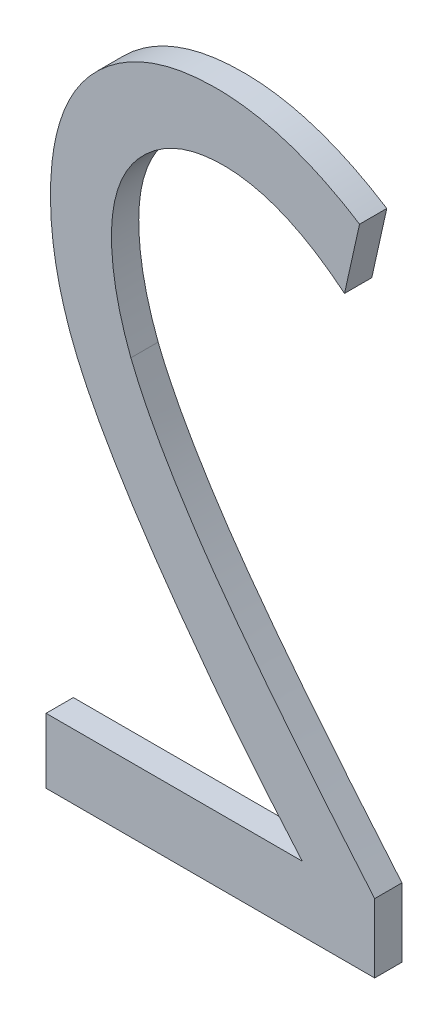
ISO-10303-21;
HEADER;
FILE_DESCRIPTION(('STEP AP214'),'2;1');
FILE_NAME('part.step','',(''),(''),'','','');
FILE_SCHEMA(('AUTOMOTIVE_DESIGN { 1 0 10303 214 1 1 1 1 }'));
ENDSEC;
DATA;
#1=APPLICATION_CONTEXT('core data for automotive mechanical design processes');
#2=APPLICATION_PROTOCOL_DEFINITION('international standard','automotive_design',2000,#1);
#3=PRODUCT_CONTEXT('',#1,'mechanical');
#4=PRODUCT('Part','Part','',(#3));
#5=PRODUCT_RELATED_PRODUCT_CATEGORY('part','',(#4));
#6=PRODUCT_DEFINITION_FORMATION('','',#4);
#7=PRODUCT_DEFINITION_CONTEXT('part definition',#1,'design');
#8=PRODUCT_DEFINITION('design','',#6,#7);
#9=PRODUCT_DEFINITION_SHAPE('','',#8);
#10=(LENGTH_UNIT() NAMED_UNIT(*) SI_UNIT(.MILLI.,.METRE.));
#11=(NAMED_UNIT(*) PLANE_ANGLE_UNIT() SI_UNIT($,.RADIAN.));
#12=(NAMED_UNIT(*) SI_UNIT($,.STERADIAN.) SOLID_ANGLE_UNIT());
#13=UNCERTAINTY_MEASURE_WITH_UNIT(LENGTH_MEASURE(1.E-05),#10,'distance_accuracy_value','');
#14=(GEOMETRIC_REPRESENTATION_CONTEXT(3) GLOBAL_UNCERTAINTY_ASSIGNED_CONTEXT((#13)) GLOBAL_UNIT_ASSIGNED_CONTEXT((#10,
#11,#12)) REPRESENTATION_CONTEXT('',''));
#15=CARTESIAN_POINT('',(0.,0.,0.));
#16=DIRECTION('',(0.,0.,1.));
#17=DIRECTION('',(1.,0.,0.));
#18=AXIS2_PLACEMENT_3D('',#15,#16,#17);
#19=CARTESIAN_POINT('',(172.152131752685,125.948278329335,-39.));
#20=DIRECTION('',(0.,0.,1.));
#21=DIRECTION('',(1.,0.,0.));
#22=AXIS2_PLACEMENT_3D('',#19,#20,#21);
#23=PLANE('',#22);
#24=DIRECTION('',(1.,0.,0.));
#25=VECTOR('',#24,1.);
#26=CARTESIAN_POINT('',(172.152131752685,125.152214694954,-39.));
#27=LINE('',#26,#25);
#28=CARTESIAN_POINT('',(172.504372600126,125.152214694954,-39.));
#29=VERTEX_POINT('',#28);
#30=CARTESIAN_POINT('',(171.564829497766,125.152214694954,-39.));
#31=VERTEX_POINT('',#30);
#32=EDGE_CURVE('E128',#29,#31,#27,.F.);
#33=ORIENTED_EDGE('',*,*,#32,.T.);
#34=DIRECTION('',(0.,1.,0.));
#35=VECTOR('',#34,1.);
#36=CARTESIAN_POINT('',(171.564829497766,125.948278329335,-39.));
#37=LINE('',#36,#35);
#38=CARTESIAN_POINT('',(171.564829497766,124.913993413852,-39.));
#39=VERTEX_POINT('',#38);
#40=EDGE_CURVE('E108',#31,#39,#37,.F.);
#41=ORIENTED_EDGE('',*,*,#40,.T.);
#42=DIRECTION('',(1.,0.,0.));
#43=VECTOR('',#42,1.);
#44=CARTESIAN_POINT('',(172.152131752685,124.913993413852,-39.));
#45=LINE('',#44,#43);
#46=CARTESIAN_POINT('',(172.769928576398,124.913993413852,-39.));
#47=VERTEX_POINT('',#46);
#48=EDGE_CURVE('E104',#39,#47,#45,.T.);
#49=ORIENTED_EDGE('',*,*,#48,.T.);
#50=DIRECTION('',(0.,1.,0.));
#51=VECTOR('',#50,1.);
#52=CARTESIAN_POINT('',(172.769928576398,124.913993413852,-39.));
#53=LINE('',#52,#51);
#54=CARTESIAN_POINT('',(172.769928576398,125.166110936351,-39.));
#55=VERTEX_POINT('',#54);
#56=EDGE_CURVE('E102',#55,#47,#53,.F.);
#57=ORIENTED_EDGE('',*,*,#56,.F.);
#58=CARTESIAN_POINT('',(171.87582280838,126.436624435557,-39.));
#59=CARTESIAN_POINT('',(171.881983858144,126.421132313016,-39.));
#60=CARTESIAN_POINT('',(171.888443153463,126.405762428981,-39.));
#61=CARTESIAN_POINT('',(171.901871322364,126.375247302634,-39.));
#62=CARTESIAN_POINT('',(171.90884016978,126.360102048836,-39.));
#63=CARTESIAN_POINT('',(171.923200941284,126.3300152623,-39.));
#64=CARTESIAN_POINT('',(171.930592851294,126.315073722804,-39.));
#65=CARTESIAN_POINT('',(171.945739448055,126.285376729993,-39.));
#66=CARTESIAN_POINT('',(171.953494126673,126.270621272514,-39.));
#67=CARTESIAN_POINT('',(171.977229339857,126.226603293513,-39.));
#68=CARTESIAN_POINT('',(171.993679195379,126.197592989437,-39.));
#69=CARTESIAN_POINT('',(172.019075462227,126.154512475279,-39.));
#70=CARTESIAN_POINT('',(172.027660405136,126.140225937032,-39.));
#71=CARTESIAN_POINT('',(172.053742700012,126.097562698147,-39.));
#72=CARTESIAN_POINT('',(172.071566375779,126.069384376933,-39.));
#73=CARTESIAN_POINT('',(172.098821546063,126.027460170251,-39.));
#74=CARTESIAN_POINT('',(172.107992817339,126.013543222797,-39.));
#75=CARTESIAN_POINT('',(172.1357651372,125.971961757683,-39.));
#76=CARTESIAN_POINT('',(172.154623669505,125.944468232993,-39.));
#77=CARTESIAN_POINT('',(172.192975090024,125.889930433792,-39.));
#78=CARTESIAN_POINT('',(172.212467962489,125.862886148153,-39.));
#79=CARTESIAN_POINT('',(172.25189245836,125.809121395733,-39.));
#80=CARTESIAN_POINT('',(172.271824072452,125.782400922097,-39.));
#81=CARTESIAN_POINT('',(172.312040551999,125.729228009605,-39.));
#82=CARTESIAN_POINT('',(172.332325413574,125.70277556781,-39.));
#83=CARTESIAN_POINT('',(172.373178187355,125.650090768106,-39.));
#84=CARTESIAN_POINT('',(172.393746097793,125.623858408825,-39.));
#85=CARTESIAN_POINT('',(172.435117903595,125.571580851571,-39.));
#86=CARTESIAN_POINT('',(172.455921798059,125.545535652887,-39.));
#87=CARTESIAN_POINT('',(172.518632028841,125.467638921907,-39.));
#88=CARTESIAN_POINT('',(172.560836279493,125.416027066146,-39.));
#89=CARTESIAN_POINT('',(172.624587732708,125.338980235817,-39.));
#90=CARTESIAN_POINT('',(172.64591217377,125.31336004769,-39.));
#91=CARTESIAN_POINT('',(172.701353589732,125.247101268435,-39.));
#92=CARTESIAN_POINT('',(172.735572534049,125.206547984025,-39.));
#93=CARTESIAN_POINT('',(172.769928576398,125.166110936351,-39.));
#94=B_SPLINE_CURVE_WITH_KNOTS('',3,(#58,#59,#60,#61,#62,#63,#64,#65,#66,#67,#68,#69,#70,#71,#72,
#73,#74,#75,#76,#77,#78,#79,#80,#81,#82,#83,#84,#85,#86,#87,#88,#89,#90,#91,#92,#93),
.UNSPECIFIED.,.F.,.F.,(4,2,2,2,2,2,2,2,2,2,2,2,2,2,2,2,2,4),(0.,0.0500087757287094,
0.100014985312841,0.150019531808065,0.200022957623796,0.300042550380344,0.35004422430103,
0.450054488447379,0.500055433134822,0.600063057039073,0.700068199814375,0.800071221646831,
0.90007314568391,1.00007444573219,1.10007536526154,1.30008029152962,1.40008068587392,
1.55926333786806),.UNSPECIFIED.);
#95=CARTESIAN_POINT('',(171.87582280838,126.436624435557,-39.));
#96=VERTEX_POINT('',#95);
#97=EDGE_CURVE('E24',#96,#55,#94,.T.);
#98=ORIENTED_EDGE('',*,*,#97,.F.);
#99=CARTESIAN_POINT('',(172.659364396163,127.032839364091,-39.));
#100=CARTESIAN_POINT('',(172.633559644265,127.053892125233,-39.));
#101=CARTESIAN_POINT('',(172.60687374249,127.074000949937,-39.));
#102=CARTESIAN_POINT('',(172.551328052937,127.111647626545,-39.));
#103=CARTESIAN_POINT('',(172.522447439633,127.129154494778,-39.));
#104=CARTESIAN_POINT('',(172.462515914962,127.16048662411,-39.));
#105=CARTESIAN_POINT('',(172.431454700589,127.17429268314,-39.));
#106=CARTESIAN_POINT('',(172.3675885985,127.196769154013,-39.));
#107=CARTESIAN_POINT('',(172.334791698886,127.205461184089,-39.));
#108=CARTESIAN_POINT('',(172.288117585217,127.213244571093,-39.));
#109=CARTESIAN_POINT('',(172.274655790862,127.214968783175,-39.));
#110=CARTESIAN_POINT('',(172.247632643865,127.217341189161,-39.));
#111=CARTESIAN_POINT('',(172.234071276289,127.217989218195,-39.));
#112=CARTESIAN_POINT('',(172.206932343972,127.218225631912,-39.));
#113=CARTESIAN_POINT('',(172.193354774423,127.217813431986,-39.));
#114=CARTESIAN_POINT('',(172.166279612185,127.215908870563,-39.));
#115=CARTESIAN_POINT('',(172.152782001622,127.214416760413,-39.));
#116=CARTESIAN_POINT('',(172.117487953358,127.208876445988,-39.));
#117=CARTESIAN_POINT('',(172.095835755627,127.203808940999,-39.));
#118=CARTESIAN_POINT('',(172.053728568641,127.190100637508,-39.));
#119=CARTESIAN_POINT('',(172.033271275275,127.181466993905,-39.));
#120=CARTESIAN_POINT('',(171.994165165284,127.160663213691,-39.));
#121=CARTESIAN_POINT('',(171.97552048043,127.148485238908,-39.));
#122=CARTESIAN_POINT('',(171.94934009155,127.127964627676,-39.));
#123=CARTESIAN_POINT('',(171.940900933963,127.120737580784,-39.));
#124=CARTESIAN_POINT('',(171.924618260857,127.105636316063,-39.));
#125=CARTESIAN_POINT('',(171.916774793972,127.097762045503,-39.));
#126=CARTESIAN_POINT('',(171.901789648385,127.081401713745,-39.));
#127=CARTESIAN_POINT('',(171.894646393252,127.072917105028,-39.));
#128=CARTESIAN_POINT('',(171.881170259032,127.055332912896,-39.));
#129=CARTESIAN_POINT('',(171.874837130112,127.046233520402,-39.));
#130=CARTESIAN_POINT('',(171.857140554517,127.018179588418,-39.));
#131=CARTESIAN_POINT('',(171.847031651905,126.998416641935,-39.));
#132=CARTESIAN_POINT('',(171.828931987802,126.954227978385,-39.));
#133=CARTESIAN_POINT('',(171.821539713918,126.92956239722,-39.));
#134=CARTESIAN_POINT('',(171.810820590911,126.879305951644,-39.));
#135=CARTESIAN_POINT('',(171.807510280605,126.853711752753,-39.));
#136=CARTESIAN_POINT('',(171.804523608971,126.806551172575,-39.));
#137=CARTESIAN_POINT('',(171.804341920893,126.785009869473,-39.));
#138=CARTESIAN_POINT('',(171.805704718384,126.741972564921,-39.));
#139=CARTESIAN_POINT('',(171.807250614432,126.720476614865,-39.));
#140=CARTESIAN_POINT('',(171.811956729691,126.677627307791,-39.));
#141=CARTESIAN_POINT('',(171.815119671551,126.656274252997,-39.));
#142=CARTESIAN_POINT('',(171.822888095236,126.613847555166,-39.));
#143=CARTESIAN_POINT('',(171.827492830647,126.59277377342,-39.));
#144=CARTESIAN_POINT('',(171.838520012912,126.548827276361,-39.));
#145=CARTESIAN_POINT('',(171.845079600649,126.525989308046,-39.));
#146=CARTESIAN_POINT('',(171.859514075183,126.480899623098,-39.));
#147=CARTESIAN_POINT('',(171.867379863856,126.458645005542,-39.));
#148=CARTESIAN_POINT('',(171.87582280838,126.436624435557,-39.));
#149=B_SPLINE_CURVE_WITH_KNOTS('',3,(#99,#100,#101,#102,#103,#104,#105,#106,#107,#108,#109,#110,
#111,#112,#113,#114,#115,#116,#117,#118,#119,#120,#121,#122,#123,#124,#125,#126,#127,#128,#129,
#130,#131,#132,#133,#134,#135,#136,#137,#138,#139,#140,#141,#142,#143,#144,#145,#146,#147,#148),
.UNSPECIFIED.,.F.,.F.,(4,2,2,2,2,2,2,2,2,2,2,2,2,2,2,2,2,2,2,2,2,2,2,2,4),(0.,0.100017091060479,
0.201143319787862,0.302784519930578,0.403992912424064,0.444673257895539,0.485359834994031,
0.52606885149195,0.566768396115581,0.633179965507767,0.699458932732195,0.765885602128108,
0.799188569711476,0.8324942532661,0.865723143215698,0.89894176098142,0.965167907700952,
1.04200009693045,1.11914257357748,1.18368228735446,1.24827473282419,1.31297629366199,
1.37764441378679,1.44888237926652,1.51964349919595),.UNSPECIFIED.);
#150=CARTESIAN_POINT('',(172.659364396163,127.032839364091,-39.));
#151=VERTEX_POINT('',#150);
#152=EDGE_CURVE('E89',#151,#96,#149,.T.);
#153=ORIENTED_EDGE('',*,*,#152,.F.);
#154=DIRECTION('',(0.217054100601005,0.976159575792959,0.));
#155=VECTOR('',#154,1.);
#156=CARTESIAN_POINT('',(172.659364396163,127.032839364091,-39.));
#157=LINE('',#156,#155);
#158=CARTESIAN_POINT('',(172.714394056645,127.280324806124,-39.));
#159=VERTEX_POINT('',#158);
#160=EDGE_CURVE('E125',#159,#151,#157,.F.);
#161=ORIENTED_EDGE('',*,*,#160,.F.);
#162=CARTESIAN_POINT('',(172.504372600126,125.152214694954,-39.));
#163=CARTESIAN_POINT('',(172.482492762864,125.177352437158,-39.));
#164=CARTESIAN_POINT('',(172.460739243117,125.202599393354,-39.));
#165=CARTESIAN_POINT('',(172.417498566375,125.253346808572,-39.));
#166=CARTESIAN_POINT('',(172.396011579383,125.278847412402,-39.));
#167=CARTESIAN_POINT('',(172.331926903966,125.355837055005,-39.));
#168=CARTESIAN_POINT('',(172.289791775207,125.407715208436,-39.));
#169=CARTESIAN_POINT('',(172.207202430537,125.512802634338,-39.));
#170=CARTESIAN_POINT('',(172.166748471857,125.566012108527,-39.));
#171=CARTESIAN_POINT('',(172.087061356273,125.673272051005,-39.));
#172=CARTESIAN_POINT('',(172.047827300038,125.727321853466,-39.));
#173=CARTESIAN_POINT('',(171.97102675812,125.836590482849,-39.));
#174=CARTESIAN_POINT('',(171.933459987957,125.891809107946,-39.));
#175=CARTESIAN_POINT('',(171.871107820414,125.987709087949,-39.));
#176=CARTESIAN_POINT('',(171.845748306276,126.02801472736,-39.));
#177=CARTESIAN_POINT('',(171.808921498936,126.089258759104,-39.));
#178=CARTESIAN_POINT('',(171.79683640872,126.109825488198,-39.));
#179=CARTESIAN_POINT('',(171.77316147344,126.151254066613,-39.));
#180=CARTESIAN_POINT('',(171.761571824543,126.172116028556,-39.));
#181=CARTESIAN_POINT('',(171.739959986746,126.212411939061,-39.));
#182=CARTESIAN_POINT('',(171.7298878386,126.2318190186,-39.));
#183=CARTESIAN_POINT('',(171.710382137046,126.270952836367,-39.));
#184=CARTESIAN_POINT('',(171.700948557389,126.290679561413,-39.));
#185=CARTESIAN_POINT('',(171.682959550204,126.330528332224,-39.));
#186=CARTESIAN_POINT('',(171.674403928558,126.350650289425,-39.));
#187=CARTESIAN_POINT('',(171.658309446416,126.391295204578,-39.));
#188=CARTESIAN_POINT('',(171.650770591596,126.411818164769,-39.));
#189=CARTESIAN_POINT('',(171.629799032765,126.473796303652,-39.));
#190=CARTESIAN_POINT('',(171.617946434945,126.515802675121,-39.));
#191=CARTESIAN_POINT('',(171.598975205878,126.600863530484,-39.));
#192=CARTESIAN_POINT('',(171.591855090857,126.643917681475,-39.));
#193=CARTESIAN_POINT('',(171.582332013781,126.733481552714,-39.));
#194=CARTESIAN_POINT('',(171.580279793396,126.78002840288,-39.));
#195=CARTESIAN_POINT('',(171.582099409016,126.87310226004,-39.));
#196=CARTESIAN_POINT('',(171.585974373764,126.919629243576,-39.));
#197=CARTESIAN_POINT('',(171.599697933708,126.999095193341,-39.));
#198=CARTESIAN_POINT('',(171.607672304554,127.032341061517,-39.));
#199=CARTESIAN_POINT('',(171.628790119704,127.09708636468,-39.));
#200=CARTESIAN_POINT('',(171.641916716429,127.12859111382,-39.));
#201=CARTESIAN_POINT('',(171.674044742596,127.188983979123,-39.));
#202=CARTESIAN_POINT('',(171.693109510912,127.217839319992,-39.));
#203=CARTESIAN_POINT('',(171.725755690384,127.257792320831,-39.));
#204=CARTESIAN_POINT('',(171.737330993901,127.270570001373,-39.));
#205=CARTESIAN_POINT('',(171.761695619059,127.294911409495,-39.));
#206=CARTESIAN_POINT('',(171.774485173018,127.306474903873,-39.));
#207=CARTESIAN_POINT('',(171.810567803865,127.336203641336,-39.));
#208=CARTESIAN_POINT('',(171.834845948962,127.353194685371,-39.));
#209=CARTESIAN_POINT('',(171.885841152411,127.382992521343,-39.));
#210=CARTESIAN_POINT('',(171.912557635287,127.39580029733,-39.));
#211=CARTESIAN_POINT('',(171.954525770422,127.412072707861,-39.));
#212=CARTESIAN_POINT('',(171.969200375528,127.417086607056,-39.));
#213=CARTESIAN_POINT('',(171.998880684564,127.425971632875,-39.));
#214=CARTESIAN_POINT('',(172.013886110563,127.429843682218,-39.));
#215=CARTESIAN_POINT('',(172.044154471625,127.436506777138,-39.));
#216=CARTESIAN_POINT('',(172.059417737942,127.439296300942,-39.));
#217=CARTESIAN_POINT('',(172.090100550103,127.443853768477,-39.));
#218=CARTESIAN_POINT('',(172.105520166112,127.445621230833,-39.));
#219=CARTESIAN_POINT('',(172.143871406363,127.448853705655,-39.));
#220=CARTESIAN_POINT('',(172.166850783782,127.449764858281,-39.));
#221=CARTESIAN_POINT('',(172.212802502708,127.449688055442,-39.));
#222=CARTESIAN_POINT('',(172.235774843176,127.448699893226,-39.));
#223=CARTESIAN_POINT('',(172.30455631203,127.442778122788,-39.));
#224=CARTESIAN_POINT('',(172.350133298979,127.434879051073,-39.));
#225=CARTESIAN_POINT('',(172.45183364362,127.409022693598,-39.));
#226=CARTESIAN_POINT('',(172.507392945872,127.388889899008,-39.));
#227=CARTESIAN_POINT('',(172.587507580339,127.352364040463,-39.));
#228=CARTESIAN_POINT('',(172.613614450693,127.339174678222,-39.));
#229=CARTESIAN_POINT('',(172.66477153901,127.311014787855,-39.));
#230=CARTESIAN_POINT('',(172.689824134707,127.296048594945,-39.));
#231=CARTESIAN_POINT('',(172.714394056645,127.280324806124,-39.));
#232=B_SPLINE_CURVE_WITH_KNOTS('',3,(#162,#163,#164,#165,#166,#167,#168,#169,#170,#171,#172,
#173,#174,#175,#176,#177,#178,#179,#180,#181,#182,#183,#184,#185,#186,#187,#188,#189,#190,#191,
#192,#193,#194,#195,#196,#197,#198,#199,#200,#201,#202,#203,#204,#205,#206,#207,#208,#209,#210,
#211,#212,#213,#214,#215,#216,#217,#218,#219,#220,#221,#222,#223,#224,#225,#226,#227,#228,#229,
#230,#231),.UNSPECIFIED.,.F.,.F.,(4,2,2,2,2,2,2,2,2,2,2,2,2,2,2,2,2,2,2,2,2,2,2,2,2,2,2,2,2,2,2,
2,2,2,4),(0.,0.099976771829443,0.200014333832972,0.400482694365182,0.600981615675607,
0.801329041651543,1.00164215072506,1.14446996126358,1.21602823502692,1.287614584054,
1.3532007974103,1.41878431310214,1.48435329691101,1.54992264675616,1.68059526903079,
1.81122690217357,1.95067370479315,2.09019414161864,2.19241019688154,2.29429475748385,
2.39730559425315,2.44895088202885,2.5006060708841,2.58910563433528,2.67758436456468,
2.72406792285507,2.77051381463408,2.81702476375671,2.86355760104138,2.93246017383222,
3.00137024746999,3.13947724549421,3.31572993405272,3.40342355584606,3.49090745239214),.UNSPECIFIED.);
#233=EDGE_CURVE('E173',#29,#159,#232,.T.);
#234=ORIENTED_EDGE('',*,*,#233,.F.);
#235=EDGE_LOOP('',(#33,#41,#49,#57,#98,#153,#161,#234));
#236=FACE_BOUND('',#235,.T.);
#237=ADVANCED_FACE('F17',(#236),#23,.T.);
#238=CARTESIAN_POINT('',(172.769928576398,124.913993413852,-39.1));
#239=DIRECTION('',(1.,0.,0.));
#240=DIRECTION('',(0.,0.,-1.));
#241=AXIS2_PLACEMENT_3D('',#238,#239,#240);
#242=PLANE('',#241);
#243=DIRECTION('',(0.,1.,0.));
#244=VECTOR('',#243,1.);
#245=CARTESIAN_POINT('',(172.769928576398,125.948278329335,-39.1));
#246=LINE('',#245,#244);
#247=CARTESIAN_POINT('',(172.769928576398,124.913993413852,-39.1));
#248=VERTEX_POINT('',#247);
#249=CARTESIAN_POINT('',(172.769928576398,125.166110936351,-39.1));
#250=VERTEX_POINT('',#249);
#251=EDGE_CURVE('E112',#248,#250,#246,.T.);
#252=ORIENTED_EDGE('',*,*,#251,.T.);
#253=DIRECTION('',(0.,0.,-1.));
#254=VECTOR('',#253,1.);
#255=CARTESIAN_POINT('',(172.769928576398,125.166110936351,-39.05));
#256=LINE('',#255,#254);
#257=EDGE_CURVE('E98',#55,#250,#256,.T.);
#258=ORIENTED_EDGE('',*,*,#257,.F.);
#259=ORIENTED_EDGE('',*,*,#56,.T.);
#260=DIRECTION('',(0.,0.,-1.));
#261=VECTOR('',#260,1.);
#262=CARTESIAN_POINT('',(172.769928576398,124.913993413852,-39.1));
#263=LINE('',#262,#261);
#264=EDGE_CURVE('E117',#248,#47,#263,.F.);
#265=ORIENTED_EDGE('',*,*,#264,.F.);
#266=EDGE_LOOP('',(#252,#258,#259,#265));
#267=FACE_BOUND('',#266,.T.);
#268=ADVANCED_FACE('F111',(#267),#242,.T.);
#269=CARTESIAN_POINT('',(172.769928576398,125.166110936351,-39.1));
#270=CARTESIAN_POINT('',(172.769928576398,125.166110936351,-39.));
#271=CARTESIAN_POINT('',(172.478119918061,125.509546616605,-39.1));
#272=CARTESIAN_POINT('',(172.478119918061,125.509546616605,-39.));
#273=CARTESIAN_POINT('',(172.26557416519,125.780192460967,-39.1));
#274=CARTESIAN_POINT('',(172.26557416519,125.780192460967,-39.));
#275=CARTESIAN_POINT('',(172.011179993121,126.15641099938,-39.1));
#276=CARTESIAN_POINT('',(172.011179993121,126.15641099938,-39.));
#277=CARTESIAN_POINT('',(171.926308735428,126.309573085637,-39.1));
#278=CARTESIAN_POINT('',(171.926308735428,126.309573085637,-39.));
#279=CARTESIAN_POINT('',(171.87582280838,126.436624435557,-39.1));
#280=CARTESIAN_POINT('',(171.87582280838,126.436624435557,-39.));
#281=B_SPLINE_SURFACE_WITH_KNOTS('',3,1,((#269,#270),(#271,#272),(#273,#274),(#275,#276),(#277,
#278),(#279,#280)),.UNSPECIFIED.,.F.,.F.,.F.,(4,2,4),(2,2),(0.,0.525907121177191,1.),(1.,1.1),.UNSPECIFIED.);
#282=CARTESIAN_POINT('',(172.769928576398,125.166110936351,-39.1));
#283=CARTESIAN_POINT('',(172.748345551071,125.191513419227,-39.1));
#284=CARTESIAN_POINT('',(172.726816850873,125.216962250277,-39.1));
#285=CARTESIAN_POINT('',(172.68388327595,125.267964156109,-39.1));
#286=CARTESIAN_POINT('',(172.662478401303,125.293517230956,-39.1));
#287=CARTESIAN_POINT('',(172.630475383614,125.331933634558,-39.1));
#288=CARTESIAN_POINT('',(172.619825105124,125.344753553456,-39.1));
#289=CARTESIAN_POINT('',(172.587929736868,125.38325948921,-39.0999999999999));
#290=CARTESIAN_POINT('',(172.566740191261,125.408991593318,-39.1));
#291=CARTESIAN_POINT('',(172.535083192038,125.447693752213,-39.1));
#292=CARTESIAN_POINT('',(172.524552095235,125.460611785303,-39.1));
#293=CARTESIAN_POINT('',(172.503535631384,125.486484993364,-39.1));
#294=CARTESIAN_POINT('',(172.493050264346,125.499440168343,-39.1));
#295=CARTESIAN_POINT('',(172.461667752604,125.538365440216,-39.1));
#296=CARTESIAN_POINT('',(172.440844332202,125.564395119262,-39.1));
#297=CARTESIAN_POINT('',(172.409783487158,125.603577551715,-39.1));
#298=CARTESIAN_POINT('',(172.39945894737,125.616661312678,-39.1));
#299=CARTESIAN_POINT('',(172.378873505336,125.64287884194,-39.1));
#300=CARTESIAN_POINT('',(172.368612603123,125.656012610264,-39.1));
#301=CARTESIAN_POINT('',(172.348160773255,125.682334544677,-39.1));
#302=CARTESIAN_POINT('',(172.337969845645,125.695522710801,-39.1));
#303=CARTESIAN_POINT('',(172.317665465977,125.721958591561,-39.1));
#304=CARTESIAN_POINT('',(172.307552013983,125.735206306246,-39.1));
#305=CARTESIAN_POINT('',(172.287411477189,125.761767281336,-39.1));
#306=CARTESIAN_POINT('',(172.277384392483,125.775080541813,-39.1));
#307=CARTESIAN_POINT('',(172.257427376214,125.801779752349,-39.1));
#308=CARTESIAN_POINT('',(172.247497444796,125.815165702517,-39.1));
#309=CARTESIAN_POINT('',(172.227747634364,125.842018656015,-39.1));
#310=CARTESIAN_POINT('',(172.217927755575,125.855485659511,-39.1));
#311=CARTESIAN_POINT('',(172.19841511689,125.882511554603,-39.1));
#312=CARTESIAN_POINT('',(172.188722357361,125.896070446465,-39.1));
#313=CARTESIAN_POINT('',(172.16948167454,125.923290901017,-39.1));
#314=CARTESIAN_POINT('',(172.159933751861,125.936952464142,-39.1));
#315=CARTESIAN_POINT('',(172.141020397654,125.964401450942,-39.1));
#316=CARTESIAN_POINT('',(172.131654967068,125.978188875267,-39.1));
#317=CARTESIAN_POINT('',(172.113086024748,126.005872234078,-39.1));
#318=CARTESIAN_POINT('',(172.103882512332,126.019768168108,-39.1));
#319=CARTESIAN_POINT('',(172.090206608122,126.040696336037,-39.1));
#320=CARTESIAN_POINT('',(172.08566956167,126.047686393177,-39.1));
#321=CARTESIAN_POINT('',(172.072126571016,126.068701001598,-39.1));
#322=CARTESIAN_POINT('',(172.063188936829,126.082769746585,-39.1));
#323=CARTESIAN_POINT('',(172.049933733056,126.103967088467,-39.1));
#324=CARTESIAN_POINT('',(172.045540574088,126.111048516411,-39.1));
#325=CARTESIAN_POINT('',(172.036807468141,126.125244103805,-39.1));
#326=CARTESIAN_POINT('',(172.032467521198,126.132358263278,-39.1));
#327=CARTESIAN_POINT('',(172.019531563249,126.153752216135,-39.1));
#328=CARTESIAN_POINT('',(172.011019665987,126.168083115382,-39.1));
#329=CARTESIAN_POINT('',(171.998441377216,126.1896892849,-39.1));
#330=CARTESIAN_POINT('',(171.994280254651,126.196909559856,-39.1));
#331=CARTESIAN_POINT('',(171.986025162871,126.211388474837,-39.1));
#332=CARTESIAN_POINT('',(171.981931193738,126.218647114908,-39.1));
#333=CARTESIAN_POINT('',(171.973814938335,126.233204308702,-39.1));
#334=CARTESIAN_POINT('',(171.969792652168,126.24050286248,-39.1));
#335=CARTESIAN_POINT('',(171.957839951275,126.262462016431,-39.1));
#336=CARTESIAN_POINT('',(171.95002408412,126.277185427135,-39.1));
#337=CARTESIAN_POINT('',(171.938565324815,126.299406347226,-39.1));
#338=CARTESIAN_POINT('',(171.934789986831,126.306835800485,-39.1));
#339=CARTESIAN_POINT('',(171.927334619629,126.321742488232,-39.1));
#340=CARTESIAN_POINT('',(171.923654590683,126.329219722856,-39.1));
#341=CARTESIAN_POINT('',(171.916397733642,126.34422416894,-39.1));
#342=CARTESIAN_POINT('',(171.912820905903,126.351751380574,-39.1));
#343=CARTESIAN_POINT('',(171.905779500078,126.366858212728,-39.1));
#344=CARTESIAN_POINT('',(171.902314922466,126.37443783347,-39.1));
#345=CARTESIAN_POINT('',(171.895508187594,126.389651983016,-39.1));
#346=CARTESIAN_POINT('',(171.892166030974,126.397286512107,-39.1));
#347=CARTESIAN_POINT('',(171.884403158527,126.415452749111,-39.1));
#348=CARTESIAN_POINT('',(171.880041668299,126.426009763201,-39.1));
#349=CARTESIAN_POINT('',(171.87582280838,126.436624435557,-39.1));
#350=B_SPLINE_CURVE_WITH_KNOTS('',3,(#282,#283,#284,#285,#286,#287,#288,#289,#290,#291,#292,
#293,#294,#295,#296,#297,#298,#299,#300,#301,#302,#303,#304,#305,#306,#307,#308,#309,#310,#311,
#312,#313,#314,#315,#316,#317,#318,#319,#320,#321,#322,#323,#324,#325,#326,#327,#328,#329,#330,
#331,#332,#333,#334,#335,#336,#337,#338,#339,#340,#341,#342,#343,#344,#345,#346,#347,#348,#349),
.UNSPECIFIED.,.F.,.F.,(4,2,2,2,2,2,2,2,2,2,2,2,2,2,2,2,2,2,2,2,2,2,2,2,2,2,2,2,2,2,2,2,2,4),(0.,
0.100000254559602,0.200000571502422,0.250000619652506,0.350001075308066,0.400001146390097,
0.450001228333166,0.550002031145744,0.60000216263042,0.650002319417806,0.70000250845809,
0.750002739259398,0.80000302510388,0.850003384993701,0.900003846872072,0.950004453168597,
1.00000527079355,1.05000634658727,1.10000721193615,1.1250073366195,1.17500846167312,
1.20000862614633,1.22500880769712,1.27501047539736,1.30001072513171,1.32501100520883,
1.35001132079569,1.40001430863975,1.42501477479511,1.45001531215107,1.47501593588363,
1.500016665347,1.52501752549406,1.55928215406868),.UNSPECIFIED.);
#351=CARTESIAN_POINT('',(171.87582280838,126.436624435557,-39.1));
#352=VERTEX_POINT('',#351);
#353=EDGE_CURVE('E167',#250,#352,#350,.T.);
#354=DIRECTION('',(0.,0.,-1.));
#355=VECTOR('',#354,1.);
#356=CARTESIAN_POINT('',(171.87582280838,126.436624435557,-39.05));
#357=LINE('',#356,#355);
#358=EDGE_CURVE('E100',#96,#352,#357,.T.);
#359=ORIENTED_EDGE('',*,*,#353,.T.);
#360=ORIENTED_EDGE('',*,*,#358,.F.);
#361=ORIENTED_EDGE('',*,*,#97,.T.);
#362=ORIENTED_EDGE('',*,*,#257,.T.);
#363=EDGE_LOOP('',(#359,#360,#361,#362));
#364=FACE_BOUND('',#363,.T.);
#365=ADVANCED_FACE('F96',(#364),#281,.T.);
#366=CARTESIAN_POINT('',(171.87582280838,126.436624435557,-39.1));
#367=CARTESIAN_POINT('',(171.87582280838,126.436624435557,-39.));
#368=CARTESIAN_POINT('',(171.828366036956,126.560367156574,-39.1));
#369=CARTESIAN_POINT('',(171.828366036956,126.560367156574,-39.));
#370=CARTESIAN_POINT('',(171.804637651243,126.677492619782,-39.1));
#371=CARTESIAN_POINT('',(171.804637651243,126.677492619782,-39.));
#372=CARTESIAN_POINT('',(171.804637651243,126.91372872354,-39.1));
#373=CARTESIAN_POINT('',(171.804637651243,126.91372872354,-39.));
#374=CARTESIAN_POINT('',(171.839977800176,127.014972768008,-39.1));
#375=CARTESIAN_POINT('',(171.839977800176,127.014972768008,-39.));
#376=CARTESIAN_POINT('',(171.989135463589,127.175564468112,-39.1));
#377=CARTESIAN_POINT('',(171.989135463589,127.175564468112,-39.));
#378=CARTESIAN_POINT('',(172.090892857604,127.218122582725,-39.1));
#379=CARTESIAN_POINT('',(172.090892857604,127.218122582725,-39.));
#380=CARTESIAN_POINT('',(172.359982848769,127.218122582725,-39.1));
#381=CARTESIAN_POINT('',(172.359982848769,127.218122582725,-39.));
#382=CARTESIAN_POINT('',(172.507906615019,127.156582085107,-39.1));
#383=CARTESIAN_POINT('',(172.507906615019,127.156582085107,-39.));
#384=CARTESIAN_POINT('',(172.659364396163,127.032839364091,-39.1));
#385=CARTESIAN_POINT('',(172.659364396163,127.032839364091,-39.));
#386=B_SPLINE_SURFACE_WITH_KNOTS('',3,1,((#366,#367),(#368,#369),(#370,#371),(#372,#373),(#374,
#375),(#376,#377),(#378,#379),(#380,#381),(#382,#383),(#384,#385)),.UNSPECIFIED.,.F.,.F.,.F.,(4,
2,2,2,4),(2,2),(0.,0.206536823199461,0.441518837618003,0.702422795278628,1.),(1.,1.1),.UNSPECIFIED.);
#387=CARTESIAN_POINT('',(171.87582280838,126.436624435557,-39.1));
#388=CARTESIAN_POINT('',(171.863962520315,126.467591222721,-39.1));
#389=CARTESIAN_POINT('',(171.853224272634,126.499022059179,-39.1));
#390=CARTESIAN_POINT('',(171.83438273033,126.563315623003,-39.1));
#391=CARTESIAN_POINT('',(171.826334294514,126.596194278501,-39.1));
#392=CARTESIAN_POINT('',(171.811719464948,126.673515447798,-39.1));
#393=CARTESIAN_POINT('',(171.806490400553,126.718235286101,-39.1));
#394=CARTESIAN_POINT('',(171.804314870376,126.785328941896,-39.1));
#395=CARTESIAN_POINT('',(171.804524346432,126.80762145031,-39.1));
#396=CARTESIAN_POINT('',(171.807477099204,126.852025149074,-39.1));
#397=CARTESIAN_POINT('',(171.810215515209,126.874136605189,-39.1));
#398=CARTESIAN_POINT('',(171.818736207909,126.917993665188,-39.1));
#399=CARTESIAN_POINT('',(171.824545709991,126.939734171987,-39.1));
#400=CARTESIAN_POINT('',(171.8396527881,126.981970999731,-39.1));
#401=CARTESIAN_POINT('',(171.848944138007,127.002469466093,-39.1));
#402=CARTESIAN_POINT('',(171.865549568235,127.031740122677,-39.1));
#403=CARTESIAN_POINT('',(171.871549562201,127.041274889768,-39.1));
#404=CARTESIAN_POINT('',(171.884400927876,127.059757940471,-39.1));
#405=CARTESIAN_POINT('',(171.891252361687,127.06870618123,-39.1));
#406=CARTESIAN_POINT('',(171.905761895141,127.085949643972,-39.1));
#407=CARTESIAN_POINT('',(171.913421649991,127.094243462767,-39.1));
#408=CARTESIAN_POINT('',(171.929368698434,127.110204842734,-39.1));
#409=CARTESIAN_POINT('',(171.93765609775,127.117872297946,-39.1));
#410=CARTESIAN_POINT('',(171.954522808416,127.13218541286,-39.1));
#411=CARTESIAN_POINT('',(171.963078003483,127.138859317341,-39.1));
#412=CARTESIAN_POINT('',(171.98071995328,127.151452402684,-39.1));
#413=CARTESIAN_POINT('',(171.989806536179,127.157371825569,-39.1));
#414=CARTESIAN_POINT('',(172.017746396459,127.173875472533,-39.1));
#415=CARTESIAN_POINT('',(172.037333624403,127.183251097187,-39.1));
#416=CARTESIAN_POINT('',(172.077447644651,127.198425612609,-39.1));
#417=CARTESIAN_POINT('',(172.097953216155,127.204281757979,-39.1));
#418=CARTESIAN_POINT('',(172.139632174134,127.212877323089,-39.1));
#419=CARTESIAN_POINT('',(172.160807126064,127.215608780202,-39.1));
#420=CARTESIAN_POINT('',(172.211530860807,127.218959946058,-39.1));
#421=CARTESIAN_POINT('',(172.241164493836,127.218361539624,-39.1));
#422=CARTESIAN_POINT('',(172.299859118466,127.212126425146,-39.1));
#423=CARTESIAN_POINT('',(172.328920336553,127.206491752449,-39.1));
#424=CARTESIAN_POINT('',(172.395301523329,127.188352980361,-39.1));
#425=CARTESIAN_POINT('',(172.432158916556,127.174188957104,-39.1));
#426=CARTESIAN_POINT('',(172.503245508456,127.140245987467,-39.1));
#427=CARTESIAN_POINT('',(172.537464552651,127.120446601187,-39.1));
#428=CARTESIAN_POINT('',(172.585794393752,127.088461534642,-39.1));
#429=CARTESIAN_POINT('',(172.600951608917,127.07780126417,-39.1));
#430=CARTESIAN_POINT('',(172.630609462341,127.055807784361,-39.1));
#431=CARTESIAN_POINT('',(172.645113901851,127.04447971211,-39.1));
#432=CARTESIAN_POINT('',(172.659364396163,127.032839364091,-39.1));
#433=B_SPLINE_CURVE_WITH_KNOTS('',3,(#387,#388,#389,#390,#391,#392,#393,#394,#395,#396,#397,
#398,#399,#400,#401,#402,#403,#404,#405,#406,#407,#408,#409,#410,#411,#412,#413,#414,#415,#416,
#417,#418,#419,#420,#421,#422,#423,#424,#425,#426,#427,#428,#429,#430,#431,#432),.UNSPECIFIED.,
.F.,.F.,(4,2,2,2,2,2,2,2,2,2,2,2,2,2,2,2,2,2,2,2,2,2,4),(0.,0.0994993194009971,
0.200919116723383,0.335384102633776,0.402172627955141,0.468833049997568,0.536094583494871,
0.603236411772433,0.636992639629515,0.670751331080187,0.704580543597506,0.738415467131622,
0.770926269763869,0.803426617122741,0.868217703169782,0.931924039780539,0.995792359765011,
1.08425334405151,1.17267859404197,1.29047093347871,1.40869608177966,1.46427050942066,
1.51946240400356),.UNSPECIFIED.);
#434=CARTESIAN_POINT('',(172.659364396163,127.032839364091,-39.1));
#435=VERTEX_POINT('',#434);
#436=EDGE_CURVE('E152',#352,#435,#433,.T.);
#437=DIRECTION('',(0.,0.,1.));
#438=VECTOR('',#437,1.);
#439=CARTESIAN_POINT('',(172.659364396163,127.032839364091,-39.1));
#440=LINE('',#439,#438);
#441=EDGE_CURVE('E127',#151,#435,#440,.F.);
#442=ORIENTED_EDGE('',*,*,#436,.T.);
#443=ORIENTED_EDGE('',*,*,#441,.F.);
#444=ORIENTED_EDGE('',*,*,#152,.T.);
#445=ORIENTED_EDGE('',*,*,#358,.T.);
#446=EDGE_LOOP('',(#442,#443,#444,#445));
#447=FACE_BOUND('',#446,.T.);
#448=ADVANCED_FACE('F182',(#447),#386,.T.);
#449=CARTESIAN_POINT('',(172.659364396163,127.032839364091,-39.1));
#450=DIRECTION('',(0.976159575792959,-0.217054100601005,0.));
#451=DIRECTION('',(0.217054100601005,0.976159575792959,0.));
#452=AXIS2_PLACEMENT_3D('',#449,#450,#451);
#453=PLANE('',#452);
#454=DIRECTION('',(0.217054100601289,0.976159575792895,0.));
#455=VECTOR('',#454,1.);
#456=CARTESIAN_POINT('',(172.659364396163,127.032839364091,-39.1));
#457=LINE('',#456,#455);
#458=CARTESIAN_POINT('',(172.714394056645,127.280324806124,-39.1));
#459=VERTEX_POINT('',#458);
#460=EDGE_CURVE('E151',#435,#459,#457,.T.);
#461=ORIENTED_EDGE('',*,*,#460,.T.);
#462=DIRECTION('',(0.,0.,-1.));
#463=VECTOR('',#462,1.);
#464=CARTESIAN_POINT('',(172.714394056645,127.280324806124,-39.05));
#465=LINE('',#464,#463);
#466=EDGE_CURVE('E227',#159,#459,#465,.T.);
#467=ORIENTED_EDGE('',*,*,#466,.F.);
#468=ORIENTED_EDGE('',*,*,#160,.T.);
#469=ORIENTED_EDGE('',*,*,#441,.T.);
#470=EDGE_LOOP('',(#461,#467,#468,#469));
#471=FACE_BOUND('',#470,.T.);
#472=ADVANCED_FACE('F195',(#471),#453,.T.);
#473=CARTESIAN_POINT('',(172.714394056645,127.280324806124,-39.1));
#474=CARTESIAN_POINT('',(172.714394056645,127.280324806124,-39.));
#475=CARTESIAN_POINT('',(172.538703030518,127.392818188866,-39.1));
#476=CARTESIAN_POINT('',(172.538703030518,127.392818188866,-39.));
#477=CARTESIAN_POINT('',(172.363516863663,127.449726606018,-39.1));
#478=CARTESIAN_POINT('',(172.363516863663,127.449726606018,-39.));
#479=CARTESIAN_POINT('',(172.019202841196,127.449726606018,-39.1));
#480=CARTESIAN_POINT('',(172.019202841196,127.449726606018,-39.));
#481=CARTESIAN_POINT('',(171.878851964003,127.400097172455,-39.1));
#482=CARTESIAN_POINT('',(171.878851964003,127.400097172455,-39.));
#483=CARTESIAN_POINT('',(171.644514561924,127.189197519461,-39.1));
#484=CARTESIAN_POINT('',(171.644514561924,127.189197519461,-39.));
#485=CARTESIAN_POINT('',(171.580984994421,127.02423692894,-39.1));
#486=CARTESIAN_POINT('',(171.580984994421,127.02423692894,-39.));
#487=CARTESIAN_POINT('',(171.580984994421,126.641097701835,-39.1));
#488=CARTESIAN_POINT('',(171.580984994421,126.641097701835,-39.));
#489=CARTESIAN_POINT('',(171.617334861896,126.476989708188,-39.1));
#490=CARTESIAN_POINT('',(171.617334861896,126.476989708188,-39.));
#491=CARTESIAN_POINT('',(171.776708151778,126.121581994284,-39.1));
#492=CARTESIAN_POINT('',(171.776708151778,126.121581994284,-39.));
#493=CARTESIAN_POINT('',(171.941959372813,125.86158473201,-39.1));
#494=CARTESIAN_POINT('',(171.941959372813,125.86158473201,-39.));
#495=CARTESIAN_POINT('',(172.284317456423,125.411935642372,-39.1));
#496=CARTESIAN_POINT('',(172.284317456423,125.411935642372,-39.));
#497=CARTESIAN_POINT('',(172.389769545727,125.28389812534,-39.1));
#498=CARTESIAN_POINT('',(172.389769545727,125.28389812534,-39.));
#499=CARTESIAN_POINT('',(172.504372600126,125.152214694954,-39.1));
#500=CARTESIAN_POINT('',(172.504372600126,125.152214694954,-39.));
#501=B_SPLINE_SURFACE_WITH_KNOTS('',3,1,((#473,#474),(#475,#476),(#477,#478),(#479,#480),(#481,
#482),(#483,#484),(#485,#486),(#487,#488),(#489,#490),(#491,#492),(#493,#494),(#495,#496),(#497,
#498),(#499,#500)),.UNSPECIFIED.,.F.,.F.,.F.,(4,2,2,2,2,2,4),(2,2),(0.,0.188736121441861,
0.373095753111143,0.583082061038943,0.740413192054337,0.927985381092943,1.),(1.,1.1),.UNSPECIFIED.);
#502=CARTESIAN_POINT('',(172.714394056645,127.280324806124,-39.1));
#503=CARTESIAN_POINT('',(172.686282922242,127.298313455144,-39.1));
#504=CARTESIAN_POINT('',(172.657530101627,127.315316644728,-39.1));
#505=CARTESIAN_POINT('',(172.598557032804,127.346994768735,-39.1));
#506=CARTESIAN_POINT('',(172.568329142843,127.361655408597,-39.1));
#507=CARTESIAN_POINT('',(172.488460999932,127.395803785477,-39.1));
#508=CARTESIAN_POINT('',(172.437820566199,127.413089401918,-39.1));
#509=CARTESIAN_POINT('',(172.360219431557,127.431992232939,-39.1));
#510=CARTESIAN_POINT('',(172.334083912012,127.437121947579,-39.1));
#511=CARTESIAN_POINT('',(172.28143695188,127.444869105982,-39.1));
#512=CARTESIAN_POINT('',(172.25492562647,127.447487303279,-39.1));
#513=CARTESIAN_POINT('',(172.208835147666,127.449723079654,-39.1));
#514=CARTESIAN_POINT('',(172.189282828087,127.449952435077,-39.1));
#515=CARTESIAN_POINT('',(172.150206905973,127.449055952829,-39.1));
#516=CARTESIAN_POINT('',(172.130683304429,127.447930069436,-39.1));
#517=CARTESIAN_POINT('',(172.091804174631,127.444155711783,-39.1));
#518=CARTESIAN_POINT('',(172.072448450966,127.441509349524,-39.1));
#519=CARTESIAN_POINT('',(172.034047207757,127.434553002054,-39.1));
#520=CARTESIAN_POINT('',(172.015001596877,127.430243516255,-39.1));
#521=CARTESIAN_POINT('',(171.965679909672,127.41657360744,-39.1));
#522=CARTESIAN_POINT('',(171.935783609468,127.405738690337,-39.1));
#523=CARTESIAN_POINT('',(171.892673860266,127.38580919001,-39.1));
#524=CARTESIAN_POINT('',(171.878586943235,127.378548956475,-39.1));
#525=CARTESIAN_POINT('',(171.851089069013,127.362832374121,-39.1));
#526=CARTESIAN_POINT('',(171.83767818359,127.354375898672,-39.1));
#527=CARTESIAN_POINT('',(171.811608192196,127.336303562234,-39.1));
#528=CARTESIAN_POINT('',(171.798951344027,127.326684457232,-39.1));
#529=CARTESIAN_POINT('',(171.774487920529,127.306419172749,-39.1));
#530=CARTESIAN_POINT('',(171.762681295345,127.295773053576,-39.1));
#531=CARTESIAN_POINT('',(171.740102744845,127.273443498695,-39.1));
#532=CARTESIAN_POINT('',(171.729330158901,127.261760734587,-39.1));
#533=CARTESIAN_POINT('',(171.708919438595,127.237450624275,-39.1));
#534=CARTESIAN_POINT('',(171.699281177627,127.224823383745,-39.1));
#535=CARTESIAN_POINT('',(171.673276369421,127.18727599269,-39.1));
#536=CARTESIAN_POINT('',(171.658422479588,127.161287225983,-39.1));
#537=CARTESIAN_POINT('',(171.633014828192,127.107315297824,-39.1));
#538=CARTESIAN_POINT('',(171.622465071226,127.079330307377,-39.1));
#539=CARTESIAN_POINT('',(171.600904289654,127.007779235638,-39.1));
#540=CARTESIAN_POINT('',(171.592345996543,126.963475631324,-39.1));
#541=CARTESIAN_POINT('',(171.584646983565,126.896486105557,-39.1));
#542=CARTESIAN_POINT('',(171.582939071206,126.874015319655,-39.1));
#543=CARTESIAN_POINT('',(171.58099084868,126.829003372612,-39.1));
#544=CARTESIAN_POINT('',(171.58075056857,126.806462210039,-39.1));
#545=CARTESIAN_POINT('',(171.581817145422,126.751604179766,-39.1));
#546=CARTESIAN_POINT('',(171.583842468198,126.719300199258,-39.1));
#547=CARTESIAN_POINT('',(171.590675878053,126.6549836595,-39.1));
#548=CARTESIAN_POINT('',(171.595484518117,126.622971159445,-39.1));
#549=CARTESIAN_POINT('',(171.607735769744,126.559546251918,-39.1));
#550=CARTESIAN_POINT('',(171.615171323892,126.528132471957,-39.1));
#551=CARTESIAN_POINT('',(171.632506371917,126.466003049914,-39.1));
#552=CARTESIAN_POINT('',(171.642405310995,126.435287252332,-39.1));
#553=CARTESIAN_POINT('',(171.662873793077,126.379064403178,-39.1));
#554=CARTESIAN_POINT('',(171.673139803857,126.353445976565,-39.1));
#555=CARTESIAN_POINT('',(171.69517667596,126.302868481103,-39.1));
#556=CARTESIAN_POINT('',(171.706947660303,126.277909466356,-39.1));
#557=CARTESIAN_POINT('',(171.731529672043,126.228465017975,-39.1));
#558=CARTESIAN_POINT('',(171.74434238207,126.203980432926,-39.1));
#559=CARTESIAN_POINT('',(171.770761692415,126.155445546166,-39.1));
#560=CARTESIAN_POINT('',(171.784368290312,126.131395243133,-39.1));
#561=CARTESIAN_POINT('',(171.82313801215,126.064898190083,-39.1));
#562=CARTESIAN_POINT('',(171.848979587842,126.022847794848,-39.1));
#563=CARTESIAN_POINT('',(171.90205609618,125.939634421426,-39.1));
#564=CARTESIAN_POINT('',(171.929291287279,125.898471609874,-39.1));
#565=CARTESIAN_POINT('',(171.984798661799,125.816890051948,-39.1));
#566=CARTESIAN_POINT('',(172.013070205193,125.776470868744,-39.1));
#567=CARTESIAN_POINT('',(172.070444136574,125.696231498974,-39.1));
#568=CARTESIAN_POINT('',(172.099546480615,125.656411280895,-39.1));
#569=CARTESIAN_POINT('',(172.143855513817,125.596859130382,-39.1));
#570=CARTESIAN_POINT('',(172.158810686272,125.57693923228,-39.1));
#571=CARTESIAN_POINT('',(172.188885423208,125.537224268003,-39.1));
#572=CARTESIAN_POINT('',(172.204004984008,125.51742919905,-39.1));
#573=CARTESIAN_POINT('',(172.249738620053,125.458334121902,-39.1));
#574=CARTESIAN_POINT('',(172.280727948221,125.419323835738,-39.1));
#575=CARTESIAN_POINT('',(172.343449714754,125.341979648877,-39.1));
#576=CARTESIAN_POINT('',(172.375181299333,125.303645052183,-39.1));
#577=CARTESIAN_POINT('',(172.439308033588,125.227531481297,-39.1));
#578=CARTESIAN_POINT('',(172.471703213049,125.189752532175,-39.1));
#579=CARTESIAN_POINT('',(172.504372600126,125.152214694954,-39.1));
#580=B_SPLINE_CURVE_WITH_KNOTS('',3,(#502,#503,#504,#505,#506,#507,#508,#509,#510,#511,#512,
#513,#514,#515,#516,#517,#518,#519,#520,#521,#522,#523,#524,#525,#526,#527,#528,#529,#530,#531,
#532,#533,#534,#535,#536,#537,#538,#539,#540,#541,#542,#543,#544,#545,#546,#547,#548,#549,#550,
#551,#552,#553,#554,#555,#556,#557,#558,#559,#560,#561,#562,#563,#564,#565,#566,#567,#568,#569,
#570,#571,#572,#573,#574,#575,#576,#577,#578,#579),.UNSPECIFIED.,.F.,.F.,(4,2,2,2,2,2,2,2,2,2,2,
2,2,2,2,2,2,2,2,2,2,2,2,2,2,2,2,2,2,2,2,2,2,2,2,2,2,2,4),(0.,0.100102584894265,
0.200794428104314,0.36046229665117,0.440266988985468,0.520047729933631,0.578663048044168,
0.637280343733695,0.695816414012769,0.754334920467661,0.849236358513334,0.896731060545907,
0.944230794010361,0.991866263087054,1.03949893664818,1.08710097316739,1.13469769161149,
1.22403812784932,1.31346149854659,1.44800171908384,1.51558115721697,1.58316197936519,
1.68014023538036,1.77713776547974,1.87387666117413,1.97059378925782,2.05333700049262,
2.13608697965918,2.21897338109818,2.30185952998073,2.44988471550362,2.59793745317117,
2.74590024822761,2.89385523114673,2.96858178302646,3.04330666530747,3.19275491309735,
3.34203897630185,3.4913297544089),.UNSPECIFIED.);
#581=CARTESIAN_POINT('',(172.504372600126,125.152214694954,-39.1));
#582=VERTEX_POINT('',#581);
#583=EDGE_CURVE('E142',#459,#582,#580,.T.);
#584=DIRECTION('',(0.,0.,1.));
#585=VECTOR('',#584,1.);
#586=CARTESIAN_POINT('',(172.504372600126,125.152214694954,-39.1));
#587=LINE('',#586,#585);
#588=EDGE_CURVE('E225',#29,#582,#587,.F.);
#589=ORIENTED_EDGE('',*,*,#583,.T.);
#590=ORIENTED_EDGE('',*,*,#588,.F.);
#591=ORIENTED_EDGE('',*,*,#233,.T.);
#592=ORIENTED_EDGE('',*,*,#466,.T.);
#593=EDGE_LOOP('',(#589,#590,#591,#592));
#594=FACE_BOUND('',#593,.T.);
#595=ADVANCED_FACE('F19',(#594),#501,.T.);
#596=CARTESIAN_POINT('',(172.504372600126,125.152214694954,-39.1));
#597=DIRECTION('',(0.,1.,0.));
#598=DIRECTION('',(0.,0.,1.));
#599=AXIS2_PLACEMENT_3D('',#596,#597,#598);
#600=PLANE('',#599);
#601=DIRECTION('',(1.,0.,0.));
#602=VECTOR('',#601,1.);
#603=CARTESIAN_POINT('',(172.152131752685,125.152214694954,-39.1));
#604=LINE('',#603,#602);
#605=CARTESIAN_POINT('',(171.564829497766,125.152214694954,-39.1));
#606=VERTEX_POINT('',#605);
#607=EDGE_CURVE('E150',#582,#606,#604,.F.);
#608=ORIENTED_EDGE('',*,*,#607,.T.);
#609=DIRECTION('',(0.,0.,1.));
#610=VECTOR('',#609,1.);
#611=CARTESIAN_POINT('',(171.564829497766,125.152214694954,-39.1));
#612=LINE('',#611,#610);
#613=EDGE_CURVE('E139',#31,#606,#612,.F.);
#614=ORIENTED_EDGE('',*,*,#613,.F.);
#615=ORIENTED_EDGE('',*,*,#32,.F.);
#616=ORIENTED_EDGE('',*,*,#588,.T.);
#617=EDGE_LOOP('',(#608,#614,#615,#616));
#618=FACE_BOUND('',#617,.T.);
#619=ADVANCED_FACE('F244',(#618),#600,.T.);
#620=CARTESIAN_POINT('',(171.564829497766,125.152214694954,-39.1));
#621=DIRECTION('',(-1.,0.,0.));
#622=DIRECTION('',(0.,0.,1.));
#623=AXIS2_PLACEMENT_3D('',#620,#621,#622);
#624=PLANE('',#623);
#625=DIRECTION('',(0.,1.,0.));
#626=VECTOR('',#625,1.);
#627=CARTESIAN_POINT('',(171.564829497766,125.948278329335,-39.1));
#628=LINE('',#627,#626);
#629=CARTESIAN_POINT('',(171.564829497766,124.913993413852,-39.1));
#630=VERTEX_POINT('',#629);
#631=EDGE_CURVE('E36',#606,#630,#628,.F.);
#632=ORIENTED_EDGE('',*,*,#631,.T.);
#633=DIRECTION('',(0.,0.,-1.));
#634=VECTOR('',#633,1.);
#635=CARTESIAN_POINT('',(171.564829497766,124.913993413852,-39.1));
#636=LINE('',#635,#634);
#637=EDGE_CURVE('E44',#39,#630,#636,.T.);
#638=ORIENTED_EDGE('',*,*,#637,.F.);
#639=ORIENTED_EDGE('',*,*,#40,.F.);
#640=ORIENTED_EDGE('',*,*,#613,.T.);
#641=EDGE_LOOP('',(#632,#638,#639,#640));
#642=FACE_BOUND('',#641,.T.);
#643=ADVANCED_FACE('F248',(#642),#624,.T.);
#644=CARTESIAN_POINT('',(171.564829497766,124.913993413852,-39.1));
#645=DIRECTION('',(0.,-1.,0.));
#646=DIRECTION('',(0.,0.,-1.));
#647=AXIS2_PLACEMENT_3D('',#644,#645,#646);
#648=PLANE('',#647);
#649=DIRECTION('',(1.,0.,0.));
#650=VECTOR('',#649,1.);
#651=CARTESIAN_POINT('',(172.152131752685,124.913993413852,-39.1));
#652=LINE('',#651,#650);
#653=EDGE_CURVE('E11',#630,#248,#652,.T.);
#654=ORIENTED_EDGE('',*,*,#653,.T.);
#655=ORIENTED_EDGE('',*,*,#264,.T.);
#656=ORIENTED_EDGE('',*,*,#48,.F.);
#657=ORIENTED_EDGE('',*,*,#637,.T.);
#658=EDGE_LOOP('',(#654,#655,#656,#657));
#659=FACE_BOUND('',#658,.T.);
#660=ADVANCED_FACE('F162',(#659),#648,.T.);
#661=CARTESIAN_POINT('',(172.152131752685,125.948278329335,-39.1));
#662=DIRECTION('',(0.,0.,1.));
#663=DIRECTION('',(1.,0.,0.));
#664=AXIS2_PLACEMENT_3D('',#661,#662,#663);
#665=PLANE('',#664);
#666=ORIENTED_EDGE('',*,*,#631,.F.);
#667=ORIENTED_EDGE('',*,*,#607,.F.);
#668=ORIENTED_EDGE('',*,*,#583,.F.);
#669=ORIENTED_EDGE('',*,*,#460,.F.);
#670=ORIENTED_EDGE('',*,*,#436,.F.);
#671=ORIENTED_EDGE('',*,*,#353,.F.);
#672=ORIENTED_EDGE('',*,*,#251,.F.);
#673=ORIENTED_EDGE('',*,*,#653,.F.);
#674=EDGE_LOOP('',(#666,#667,#668,#669,#670,#671,#672,#673));
#675=FACE_BOUND('',#674,.T.);
#676=ADVANCED_FACE('F158',(#675),#665,.F.);
#677=CLOSED_SHELL('',(#237,#268,#365,#448,#472,#595,#619,#643,#660,#676));
#678=MANIFOLD_SOLID_BREP('B1',#677);
#679=ADVANCED_BREP_SHAPE_REPRESENTATION('',(#18,#678),#14);
#680=SHAPE_DEFINITION_REPRESENTATION(#9,#679);
ENDSEC;
END-ISO-10303-21;
